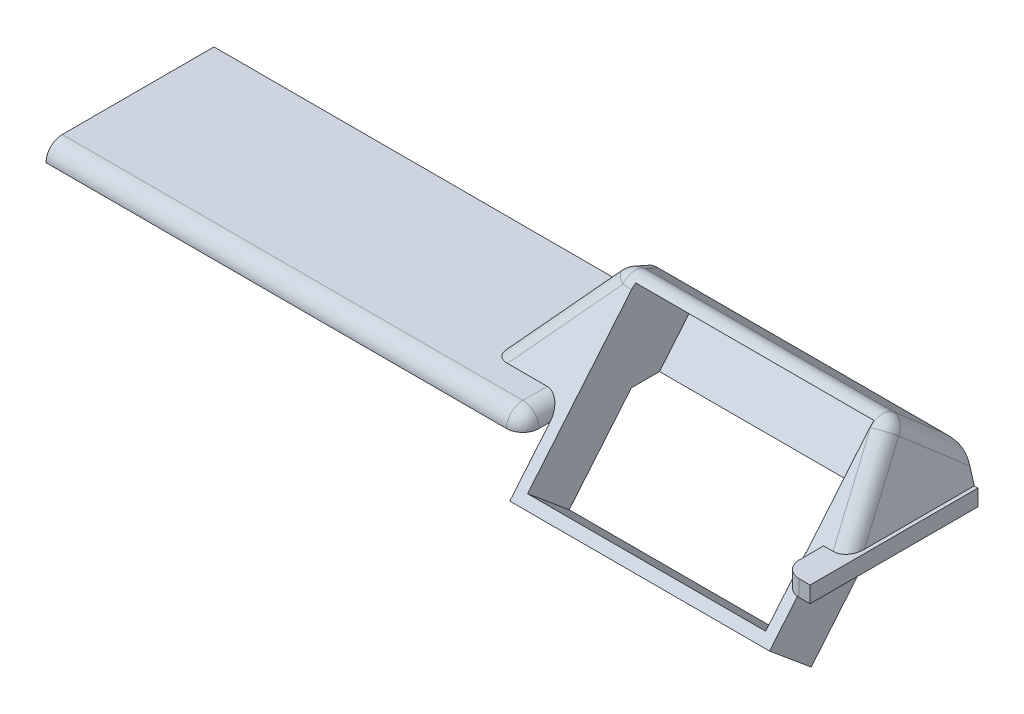
ISO-10303-21;
HEADER;
FILE_DESCRIPTION(('STEP AP214'),'2;1');
FILE_NAME('part.step','',(''),(''),'','','');
FILE_SCHEMA(('AUTOMOTIVE_DESIGN { 1 0 10303 214 1 1 1 1 }'));
ENDSEC;
DATA;
#1=APPLICATION_CONTEXT('core data for automotive mechanical design processes');
#2=APPLICATION_PROTOCOL_DEFINITION('international standard','automotive_design',2000,#1);
#3=PRODUCT_CONTEXT('',#1,'mechanical');
#4=PRODUCT('Part','Part','',(#3));
#5=PRODUCT_RELATED_PRODUCT_CATEGORY('part','',(#4));
#6=PRODUCT_DEFINITION_FORMATION('','',#4);
#7=PRODUCT_DEFINITION_CONTEXT('part definition',#1,'design');
#8=PRODUCT_DEFINITION('design','',#6,#7);
#9=PRODUCT_DEFINITION_SHAPE('','',#8);
#10=(LENGTH_UNIT() NAMED_UNIT(*) SI_UNIT(.MILLI.,.METRE.));
#11=(NAMED_UNIT(*) PLANE_ANGLE_UNIT() SI_UNIT($,.RADIAN.));
#12=(NAMED_UNIT(*) SI_UNIT($,.STERADIAN.) SOLID_ANGLE_UNIT());
#13=UNCERTAINTY_MEASURE_WITH_UNIT(LENGTH_MEASURE(1.E-05),#10,'distance_accuracy_value','');
#14=(GEOMETRIC_REPRESENTATION_CONTEXT(3) GLOBAL_UNCERTAINTY_ASSIGNED_CONTEXT((#13)) GLOBAL_UNIT_ASSIGNED_CONTEXT((#10,
#11,#12)) REPRESENTATION_CONTEXT('',''));
#15=CARTESIAN_POINT('',(0.,0.,0.));
#16=DIRECTION('',(0.,0.,1.));
#17=DIRECTION('',(1.,0.,0.));
#18=AXIS2_PLACEMENT_3D('',#15,#16,#17);
#19=CARTESIAN_POINT('',(0.,3.,0.));
#20=DIRECTION('',(0.,1.,0.));
#21=DIRECTION('',(0.,0.,1.));
#22=AXIS2_PLACEMENT_3D('',#19,#20,#21);
#23=PLANE('',#22);
#24=DIRECTION('',(1.,0.,0.));
#25=VECTOR('',#24,1.);
#26=CARTESIAN_POINT('',(14.5,3.,12.5));
#27=LINE('',#26,#25);
#28=CARTESIAN_POINT('',(-70.5,3.,12.5));
#29=VERTEX_POINT('',#28);
#30=CARTESIAN_POINT('',(14.5,3.,12.5));
#31=VERTEX_POINT('',#30);
#32=EDGE_CURVE('E59',#29,#31,#27,.T.);
#33=ORIENTED_EDGE('',*,*,#32,.T.);
#34=DIRECTION('',(0.,0.,-1.));
#35=VECTOR('',#34,1.);
#36=CARTESIAN_POINT('',(14.5,3.,0.));
#37=LINE('',#36,#35);
#38=CARTESIAN_POINT('',(14.5,3.,8.));
#39=VERTEX_POINT('',#38);
#40=EDGE_CURVE('E402',#31,#39,#37,.T.);
#41=ORIENTED_EDGE('',*,*,#40,.T.);
#42=DIRECTION('',(1.,0.,0.));
#43=VECTOR('',#42,1.);
#44=CARTESIAN_POINT('',(-17.6627305207395,3.,8.));
#45=LINE('',#44,#43);
#46=CARTESIAN_POINT('',(7.16815008911601,3.,8.));
#47=VERTEX_POINT('',#46);
#48=EDGE_CURVE('E269',#47,#39,#45,.T.);
#49=ORIENTED_EDGE('',*,*,#48,.F.);
#50=CARTESIAN_POINT('',(8.78609706855595,3.,4.09487516204668));
#51=DIRECTION('',(0.,1.,0.));
#52=DIRECTION('',(-0.710938080641439,0.,0.703254609294434));
#53=AXIS2_PLACEMENT_3D('',#50,#51,#52);
#54=ELLIPSE('',#53,4.6515928374053,3.);
#55=CARTESIAN_POINT('',(4.86343012819505,3.,5.70558670905381));
#56=VERTEX_POINT('',#55);
#57=EDGE_CURVE('E357',#47,#56,#54,.F.);
#58=ORIENTED_EDGE('',*,*,#57,.T.);
#59=DIRECTION('',(0.,0.,1.));
#60=VECTOR('',#59,1.);
#61=CARTESIAN_POINT('',(4.86343012819505,3.,-35.1133347018045));
#62=LINE('',#61,#60);
#63=CARTESIAN_POINT('',(4.86343012819505,3.,-15.5));
#64=VERTEX_POINT('',#63);
#65=EDGE_CURVE('E494',#64,#56,#62,.T.);
#66=ORIENTED_EDGE('',*,*,#65,.F.);
#67=DIRECTION('',(-1.,0.,0.));
#68=VECTOR('',#67,1.);
#69=CARTESIAN_POINT('',(-70.5,3.,-15.5));
#70=LINE('',#69,#68);
#71=CARTESIAN_POINT('',(-70.5,3.,-15.5));
#72=VERTEX_POINT('',#71);
#73=EDGE_CURVE('E284',#64,#72,#70,.T.);
#74=ORIENTED_EDGE('',*,*,#73,.T.);
#75=DIRECTION('',(0.,0.,1.));
#76=VECTOR('',#75,1.);
#77=CARTESIAN_POINT('',(-70.5,3.,-15.5));
#78=LINE('',#77,#76);
#79=EDGE_CURVE('E289',#72,#29,#78,.T.);
#80=ORIENTED_EDGE('',*,*,#79,.T.);
#81=EDGE_LOOP('',(#33,#41,#49,#58,#66,#74,#80));
#82=FACE_BOUND('',#81,.T.);
#83=ADVANCED_FACE('F42',(#82),#23,.T.);
#84=DIRECTION('',(0.,0.,1.));
#85=VECTOR('',#84,1.);
#86=CARTESIAN_POINT('',(65.5,3.,8.));
#87=LINE('',#86,#85);
#88=CARTESIAN_POINT('',(65.5,3.,8.));
#89=VERTEX_POINT('',#88);
#90=CARTESIAN_POINT('',(65.5,3.,12.5));
#91=VERTEX_POINT('',#90);
#92=EDGE_CURVE('E250',#89,#91,#87,.T.);
#93=ORIENTED_EDGE('',*,*,#92,.T.);
#94=CARTESIAN_POINT('',(68.5,3.,12.5));
#95=DIRECTION('',(0.,1.,0.));
#96=DIRECTION('',(0.,0.,1.));
#97=AXIS2_PLACEMENT_3D('',#94,#95,#96);
#98=CIRCLE('',#97,3.);
#99=CARTESIAN_POINT('',(68.5,3.,15.5));
#100=VERTEX_POINT('',#99);
#101=EDGE_CURVE('E399',#91,#100,#98,.T.);
#102=ORIENTED_EDGE('',*,*,#101,.T.);
#103=DIRECTION('',(1.,0.,0.));
#104=VECTOR('',#103,1.);
#105=CARTESIAN_POINT('',(-70.5,3.,15.5));
#106=LINE('',#105,#104);
#107=CARTESIAN_POINT('',(70.5,3.,15.5));
#108=VERTEX_POINT('',#107);
#109=EDGE_CURVE('E291',#100,#108,#106,.T.);
#110=ORIENTED_EDGE('',*,*,#109,.T.);
#111=DIRECTION('',(0.,0.,-1.));
#112=VECTOR('',#111,1.);
#113=CARTESIAN_POINT('',(70.5,3.,-15.5));
#114=LINE('',#113,#112);
#115=CARTESIAN_POINT('',(70.5,3.,-15.5));
#116=VERTEX_POINT('',#115);
#117=EDGE_CURVE('E282',#108,#116,#114,.T.);
#118=ORIENTED_EDGE('',*,*,#117,.T.);
#119=CARTESIAN_POINT('',(69.812076193566,3.,-15.5));
#120=VERTEX_POINT('',#119);
#121=EDGE_CURVE('E286',#116,#120,#70,.T.);
#122=ORIENTED_EDGE('',*,*,#121,.T.);
#123=DIRECTION('',(0.,0.,1.));
#124=VECTOR('',#123,1.);
#125=CARTESIAN_POINT('',(69.812076193566,3.,-35.1133347018045));
#126=LINE('',#125,#124);
#127=CARTESIAN_POINT('',(69.812076193566,3.,4.78558102168205));
#128=VERTEX_POINT('',#127);
#129=EDGE_CURVE('E259',#120,#128,#126,.T.);
#130=ORIENTED_EDGE('',*,*,#129,.T.);
#131=CARTESIAN_POINT('',(66.6905765469274,3.,4.09487516204668));
#132=DIRECTION('',(0.,1.,0.));
#133=DIRECTION('',(0.326107703459853,0.,0.945332621749689));
#134=AXIS2_PLACEMENT_3D('',#131,#132,#133);
#135=ELLIPSE('',#134,3.99921992943183,3.);
#136=CARTESIAN_POINT('',(67.2426813287845,3.,8.));
#137=VERTEX_POINT('',#136);
#138=EDGE_CURVE('E254',#128,#137,#135,.F.);
#139=ORIENTED_EDGE('',*,*,#138,.T.);
#140=DIRECTION('',(-1.,0.,0.));
#141=VECTOR('',#140,1.);
#142=CARTESIAN_POINT('',(95.5,3.,8.));
#143=LINE('',#142,#141);
#144=EDGE_CURVE('E247',#137,#89,#143,.T.);
#145=ORIENTED_EDGE('',*,*,#144,.T.);
#146=EDGE_LOOP('',(#93,#102,#110,#118,#122,#130,#139,#145));
#147=FACE_BOUND('',#146,.T.);
#148=ADVANCED_FACE('F249',(#147),#23,.T.);
#149=CARTESIAN_POINT('',(-70.5,3.,15.5));
#150=DIRECTION('',(0.,0.,-1.));
#151=DIRECTION('',(-1.,0.,0.));
#152=AXIS2_PLACEMENT_3D('',#149,#150,#151);
#153=PLANE('',#152);
#154=ORIENTED_EDGE('',*,*,#109,.F.);
#155=DIRECTION('',(0.,-1.,0.));
#156=VECTOR('',#155,1.);
#157=CARTESIAN_POINT('',(68.5,0.,15.5));
#158=LINE('',#157,#156);
#159=CARTESIAN_POINT('',(68.5,0.,15.5));
#160=VERTEX_POINT('',#159);
#161=EDGE_CURVE('E395',#100,#160,#158,.T.);
#162=ORIENTED_EDGE('',*,*,#161,.T.);
#163=DIRECTION('',(1.,0.,0.));
#164=VECTOR('',#163,1.);
#165=CARTESIAN_POINT('',(-70.5,0.,15.5));
#166=LINE('',#165,#164);
#167=CARTESIAN_POINT('',(70.5,0.,15.5));
#168=VERTEX_POINT('',#167);
#169=EDGE_CURVE('E301',#160,#168,#166,.T.);
#170=ORIENTED_EDGE('',*,*,#169,.T.);
#171=DIRECTION('',(0.,-1.,0.));
#172=VECTOR('',#171,1.);
#173=CARTESIAN_POINT('',(70.5,3.,15.5));
#174=LINE('',#173,#172);
#175=EDGE_CURVE('E293',#108,#168,#174,.T.);
#176=ORIENTED_EDGE('',*,*,#175,.F.);
#177=EDGE_LOOP('',(#154,#162,#170,#176));
#178=FACE_BOUND('',#177,.T.);
#179=ADVANCED_FACE('F596',(#178),#153,.F.);
#180=CARTESIAN_POINT('',(0.,0.,0.));
#181=DIRECTION('',(0.,1.,0.));
#182=DIRECTION('',(0.,0.,1.));
#183=AXIS2_PLACEMENT_3D('',#180,#181,#182);
#184=PLANE('',#183);
#185=DIRECTION('',(0.,0.,1.));
#186=VECTOR('',#185,1.);
#187=CARTESIAN_POINT('',(17.5,0.,10.5));
#188=LINE('',#187,#186);
#189=CARTESIAN_POINT('',(17.5,0.,10.5));
#190=VERTEX_POINT('',#189);
#191=CARTESIAN_POINT('',(17.5,0.,12.5));
#192=VERTEX_POINT('',#191);
#193=EDGE_CURVE('E276',#190,#192,#188,.T.);
#194=ORIENTED_EDGE('',*,*,#193,.T.);
#195=CARTESIAN_POINT('',(14.5,0.,12.5));
#196=DIRECTION('',(0.,1.,0.));
#197=DIRECTION('',(0.,0.,1.));
#198=AXIS2_PLACEMENT_3D('',#195,#196,#197);
#199=CIRCLE('',#198,3.);
#200=CARTESIAN_POINT('',(14.5,0.,15.5));
#201=VERTEX_POINT('',#200);
#202=EDGE_CURVE('E393',#192,#201,#199,.F.);
#203=ORIENTED_EDGE('',*,*,#202,.T.);
#204=CARTESIAN_POINT('',(-70.5,0.,15.5));
#205=VERTEX_POINT('',#204);
#206=EDGE_CURVE('E285',#205,#201,#166,.T.);
#207=ORIENTED_EDGE('',*,*,#206,.F.);
#208=DIRECTION('',(0.,0.,1.));
#209=VECTOR('',#208,1.);
#210=CARTESIAN_POINT('',(-70.5,0.,-15.5));
#211=LINE('',#210,#209);
#212=CARTESIAN_POINT('',(-70.5,0.,-15.5));
#213=VERTEX_POINT('',#212);
#214=EDGE_CURVE('E299',#213,#205,#211,.T.);
#215=ORIENTED_EDGE('',*,*,#214,.F.);
#216=DIRECTION('',(-1.,0.,0.));
#217=VECTOR('',#216,1.);
#218=CARTESIAN_POINT('',(-70.5,0.,-15.5));
#219=LINE('',#218,#217);
#220=CARTESIAN_POINT('',(70.5,0.,-15.5));
#221=VERTEX_POINT('',#220);
#222=EDGE_CURVE('E297',#221,#213,#219,.T.);
#223=ORIENTED_EDGE('',*,*,#222,.F.);
#224=DIRECTION('',(0.,0.,-1.));
#225=VECTOR('',#224,1.);
#226=CARTESIAN_POINT('',(70.5,0.,-15.5));
#227=LINE('',#226,#225);
#228=EDGE_CURVE('E294',#168,#221,#227,.T.);
#229=ORIENTED_EDGE('',*,*,#228,.F.);
#230=ORIENTED_EDGE('',*,*,#169,.F.);
#231=CARTESIAN_POINT('',(68.5,0.,12.5));
#232=DIRECTION('',(0.,1.,0.));
#233=DIRECTION('',(0.,0.,1.));
#234=AXIS2_PLACEMENT_3D('',#231,#232,#233);
#235=CIRCLE('',#234,3.);
#236=CARTESIAN_POINT('',(65.5,0.,12.5));
#237=VERTEX_POINT('',#236);
#238=EDGE_CURVE('E387',#160,#237,#235,.F.);
#239=ORIENTED_EDGE('',*,*,#238,.T.);
#240=DIRECTION('',(0.,0.,-1.));
#241=VECTOR('',#240,1.);
#242=CARTESIAN_POINT('',(65.5,0.,10.5));
#243=LINE('',#242,#241);
#244=CARTESIAN_POINT('',(65.5,0.,10.5));
#245=VERTEX_POINT('',#244);
#246=EDGE_CURVE('E274',#237,#245,#243,.T.);
#247=ORIENTED_EDGE('',*,*,#246,.T.);
#248=DIRECTION('',(1.,0.,0.));
#249=VECTOR('',#248,1.);
#250=CARTESIAN_POINT('',(-12.9795013082564,0.,10.5));
#251=LINE('',#250,#249);
#252=CARTESIAN_POINT('',(65.4415091486555,0.,10.5));
#253=VERTEX_POINT('',#252);
#254=EDGE_CURVE('E273',#253,#245,#251,.T.);
#255=ORIENTED_EDGE('',*,*,#254,.F.);
#256=DIRECTION('',(0.,0.,-1.));
#257=VECTOR('',#256,1.);
#258=CARTESIAN_POINT('',(65.4415091486555,0.,0.));
#259=LINE('',#258,#257);
#260=CARTESIAN_POINT('',(65.4415091486555,0.,-2.51708279317776));
#261=VERTEX_POINT('',#260);
#262=EDGE_CURVE('E426',#253,#261,#259,.T.);
#263=ORIENTED_EDGE('',*,*,#262,.T.);
#264=DIRECTION('',(1.,0.,0.));
#265=VECTOR('',#264,1.);
#266=CARTESIAN_POINT('',(0.,0.,-2.51708279317776));
#267=LINE('',#266,#265);
#268=CARTESIAN_POINT('',(63.5,0.,-2.51708279317776));
#269=VERTEX_POINT('',#268);
#270=EDGE_CURVE('E425',#269,#261,#267,.T.);
#271=ORIENTED_EDGE('',*,*,#270,.F.);
#272=DIRECTION('',(0.,0.,-1.));
#273=VECTOR('',#272,1.);
#274=CARTESIAN_POINT('',(63.5,0.,0.));
#275=LINE('',#274,#273);
#276=CARTESIAN_POINT('',(63.5,0.,-7.72391591044887));
#277=VERTEX_POINT('',#276);
#278=EDGE_CURVE('E453',#269,#277,#275,.T.);
#279=ORIENTED_EDGE('',*,*,#278,.T.);
#280=DIRECTION('',(1.,0.,0.));
#281=VECTOR('',#280,1.);
#282=CARTESIAN_POINT('',(0.,0.,-7.72391591044886));
#283=LINE('',#282,#281);
#284=CARTESIAN_POINT('',(19.5,0.,-7.72391591044887));
#285=VERTEX_POINT('',#284);
#286=EDGE_CURVE('E327',#285,#277,#283,.T.);
#287=ORIENTED_EDGE('',*,*,#286,.F.);
#288=DIRECTION('',(0.,0.,1.));
#289=VECTOR('',#288,1.);
#290=CARTESIAN_POINT('',(19.5,0.,0.));
#291=LINE('',#290,#289);
#292=CARTESIAN_POINT('',(19.5,0.,-2.51708279317775));
#293=VERTEX_POINT('',#292);
#294=EDGE_CURVE('E444',#285,#293,#291,.T.);
#295=ORIENTED_EDGE('',*,*,#294,.T.);
#296=CARTESIAN_POINT('',(17.5,0.,-2.51708279317776));
#297=VERTEX_POINT('',#296);
#298=EDGE_CURVE('E278',#297,#293,#267,.T.);
#299=ORIENTED_EDGE('',*,*,#298,.F.);
#300=DIRECTION('',(0.,0.,1.));
#301=VECTOR('',#300,1.);
#302=CARTESIAN_POINT('',(17.5,0.,0.));
#303=LINE('',#302,#301);
#304=EDGE_CURVE('E421',#297,#190,#303,.T.);
#305=ORIENTED_EDGE('',*,*,#304,.T.);
#306=EDGE_LOOP('',(#194,#203,#207,#215,#223,#229,#230,#239,#247,#255,#263,#271,#279,#287,#295,
#299,#305));
#307=FACE_BOUND('',#306,.T.);
#308=ADVANCED_FACE('F418',(#307),#184,.F.);
#309=CARTESIAN_POINT('',(70.5,3.,-15.5));
#310=DIRECTION('',(-1.,0.,0.));
#311=DIRECTION('',(0.,0.,1.));
#312=AXIS2_PLACEMENT_3D('',#309,#310,#311);
#313=PLANE('',#312);
#314=ORIENTED_EDGE('',*,*,#228,.T.);
#315=DIRECTION('',(0.,-1.,0.));
#316=VECTOR('',#315,1.);
#317=CARTESIAN_POINT('',(70.5,3.,-15.5));
#318=LINE('',#317,#316);
#319=EDGE_CURVE('E309',#116,#221,#318,.T.);
#320=ORIENTED_EDGE('',*,*,#319,.F.);
#321=ORIENTED_EDGE('',*,*,#117,.F.);
#322=ORIENTED_EDGE('',*,*,#175,.T.);
#323=EDGE_LOOP('',(#314,#320,#321,#322));
#324=FACE_BOUND('',#323,.T.);
#325=ADVANCED_FACE('F602',(#324),#313,.F.);
#326=CARTESIAN_POINT('',(-70.5,3.,-15.5));
#327=DIRECTION('',(0.,0.,1.));
#328=DIRECTION('',(1.,0.,0.));
#329=AXIS2_PLACEMENT_3D('',#326,#327,#328);
#330=PLANE('',#329);
#331=DIRECTION('',(1.,0.,0.));
#332=VECTOR('',#331,1.);
#333=CARTESIAN_POINT('',(68.1351576738459,7.42820849538,-15.5));
#334=LINE('',#333,#332);
#335=CARTESIAN_POINT('',(8.65517811175093,7.42820849537999,-15.5));
#336=VERTEX_POINT('',#335);
#337=CARTESIAN_POINT('',(68.1850973815483,7.42820849538,-15.5));
#338=VERTEX_POINT('',#337);
#339=EDGE_CURVE('E331',#336,#338,#334,.T.);
#340=ORIENTED_EDGE('',*,*,#339,.T.);
#341=CARTESIAN_POINT('',(66.1362710836501,4.92820849538,-15.5));
#342=DIRECTION('',(0.,0.,1.));
#343=DIRECTION('',(-0.276282343854148,0.961076514370453,0.));
#344=AXIS2_PLACEMENT_3D('',#341,#342,#343);
#345=ELLIPSE('',#344,3.97070523087916,3.);
#346=CARTESIAN_POINT('',(69.0195006267614,5.75705552694244,-15.5));
#347=VERTEX_POINT('',#346);
#348=EDGE_CURVE('E334',#338,#347,#345,.F.);
#349=ORIENTED_EDGE('',*,*,#348,.T.);
#350=DIRECTION('',(0.276282343854148,-0.961076514370452,0.));
#351=VECTOR('',#350,1.);
#352=CARTESIAN_POINT('',(65.5,18.,-15.5));
#353=LINE('',#352,#351);
#354=EDGE_CURVE('E497',#347,#120,#353,.T.);
#355=ORIENTED_EDGE('',*,*,#354,.T.);
#356=ORIENTED_EDGE('',*,*,#121,.F.);
#357=ORIENTED_EDGE('',*,*,#319,.T.);
#358=ORIENTED_EDGE('',*,*,#222,.T.);
#359=DIRECTION('',(0.,-1.,0.));
#360=VECTOR('',#359,1.);
#361=CARTESIAN_POINT('',(-70.5,3.,-15.5));
#362=LINE('',#361,#360);
#363=EDGE_CURVE('E306',#72,#213,#362,.T.);
#364=ORIENTED_EDGE('',*,*,#363,.F.);
#365=ORIENTED_EDGE('',*,*,#73,.F.);
#366=DIRECTION('',(0.644284618802856,0.7647858065982,0.));
#367=VECTOR('',#366,1.);
#368=CARTESIAN_POINT('',(17.5,18.,-15.5));
#369=LINE('',#368,#367);
#370=CARTESIAN_POINT('',(8.11613574071316,6.86106235178856,-15.5));
#371=VERTEX_POINT('',#370);
#372=EDGE_CURVE('E487',#64,#371,#369,.T.);
#373=ORIENTED_EDGE('',*,*,#372,.T.);
#374=CARTESIAN_POINT('',(10.4104931605078,4.92820849537999,-15.5));
#375=DIRECTION('',(0.,0.,1.));
#376=DIRECTION('',(-0.644284618802856,-0.7647858065982,0.));
#377=AXIS2_PLACEMENT_3D('',#374,#375,#376);
#378=ELLIPSE('',#377,4.43684979000056,3.);
#379=EDGE_CURVE('E329',#371,#336,#378,.F.);
#380=ORIENTED_EDGE('',*,*,#379,.T.);
#381=EDGE_LOOP('',(#340,#349,#355,#356,#357,#358,#364,#365,#373,#380));
#382=FACE_BOUND('',#381,.T.);
#383=ADVANCED_FACE('F609',(#382),#330,.F.);
#384=CARTESIAN_POINT('',(-70.5,3.,-15.5));
#385=DIRECTION('',(1.,0.,0.));
#386=DIRECTION('',(0.,0.,-1.));
#387=AXIS2_PLACEMENT_3D('',#384,#385,#386);
#388=PLANE('',#387);
#389=ORIENTED_EDGE('',*,*,#214,.T.);
#390=CARTESIAN_POINT('',(-70.5,0.,12.5));
#391=DIRECTION('',(1.,0.,0.));
#392=DIRECTION('',(0.,0.,-1.));
#393=AXIS2_PLACEMENT_3D('',#390,#391,#392);
#394=CIRCLE('',#393,3.);
#395=EDGE_CURVE('E51',#205,#29,#394,.F.);
#396=ORIENTED_EDGE('',*,*,#395,.T.);
#397=ORIENTED_EDGE('',*,*,#79,.F.);
#398=ORIENTED_EDGE('',*,*,#363,.T.);
#399=EDGE_LOOP('',(#389,#396,#397,#398));
#400=FACE_BOUND('',#399,.T.);
#401=ADVANCED_FACE('F606',(#400),#388,.F.);
#402=CARTESIAN_POINT('',(-12.9795013082564,18.,-4.5));
#403=DIRECTION('',(0.,-0.64018439966448,-0.768221279597376));
#404=DIRECTION('',(0.,0.768221279597376,-0.64018439966448));
#405=AXIS2_PLACEMENT_3D('',#402,#403,#404);
#406=PLANE('',#405);
#407=DIRECTION('',(-0.215645864426296,0.750146291761006,-0.625121909800838));
#408=VECTOR('',#407,1.);
#409=CARTESIAN_POINT('',(63.0500900613609,17.584359410251,-4.15363284187586));
#410=LINE('',#409,#408);
#411=CARTESIAN_POINT('',(63.593130873447,15.6953361612079,-2.57944680100656));
#412=VERTEX_POINT('',#411);
#413=EDGE_CURVE('E353',#137,#412,#410,.T.);
#414=ORIENTED_EDGE('',*,*,#413,.T.);
#415=DIRECTION('',(1.,0.,0.));
#416=VECTOR('',#415,1.);
#417=CARTESIAN_POINT('',(19.4741947202085,15.6953361612079,-2.57944680100656));
#418=LINE('',#417,#416);
#419=CARTESIAN_POINT('',(63.5,15.6953361612079,-2.57944680100656));
#420=VERTEX_POINT('',#419);
#421=EDGE_CURVE('E375',#412,#420,#418,.F.);
#422=ORIENTED_EDGE('',*,*,#421,.T.);
#423=DIRECTION('',(0.,0.768221279597376,-0.64018439966448));
#424=VECTOR('',#423,1.);
#425=CARTESIAN_POINT('',(63.5,3.,8.));
#426=LINE('',#425,#424);
#427=CARTESIAN_POINT('',(63.5,1.53644255919475,9.21963120067104));
#428=VERTEX_POINT('',#427);
#429=EDGE_CURVE('E484',#428,#420,#426,.T.);
#430=ORIENTED_EDGE('',*,*,#429,.F.);
#431=DIRECTION('',(1.,0.,0.));
#432=VECTOR('',#431,1.);
#433=CARTESIAN_POINT('',(63.4415091486555,1.53644255919475,9.21963120067104));
#434=LINE('',#433,#432);
#435=CARTESIAN_POINT('',(63.4415091486555,1.53644255919475,9.21963120067104));
#436=VERTEX_POINT('',#435);
#437=EDGE_CURVE('E473',#436,#428,#434,.T.);
#438=ORIENTED_EDGE('',*,*,#437,.F.);
#439=DIRECTION('',(0.,0.768221279597376,-0.64018439966448));
#440=VECTOR('',#439,1.);
#441=CARTESIAN_POINT('',(63.4415091486555,-7.3513022267134,16.6260851889278));
#442=LINE('',#441,#440);
#443=CARTESIAN_POINT('',(63.4415091486555,-7.3513022267134,16.6260851889278));
#444=VERTEX_POINT('',#443);
#445=EDGE_CURVE('E476',#444,#436,#442,.T.);
#446=ORIENTED_EDGE('',*,*,#445,.F.);
#447=DIRECTION('',(1.,0.,0.));
#448=VECTOR('',#447,1.);
#449=CARTESIAN_POINT('',(19.5,-7.35130222671341,16.6260851889278));
#450=LINE('',#449,#448);
#451=CARTESIAN_POINT('',(19.5,-7.35130222671341,16.6260851889278));
#452=VERTEX_POINT('',#451);
#453=EDGE_CURVE('E479',#452,#444,#450,.T.);
#454=ORIENTED_EDGE('',*,*,#453,.F.);
#455=DIRECTION('',(0.,-0.768221279597376,0.64018439966448));
#456=VECTOR('',#455,1.);
#457=CARTESIAN_POINT('',(19.5,0.,10.5));
#458=LINE('',#457,#456);
#459=CARTESIAN_POINT('',(19.5,15.6953361612079,-2.57944680100655));
#460=VERTEX_POINT('',#459);
#461=EDGE_CURVE('E482',#460,#452,#458,.T.);
#462=ORIENTED_EDGE('',*,*,#461,.F.);
#463=DIRECTION('',(1.,0.,0.));
#464=VECTOR('',#463,1.);
#465=CARTESIAN_POINT('',(19.4741947202085,15.6953361612079,-2.57944680100656));
#466=LINE('',#465,#464);
#467=CARTESIAN_POINT('',(17.863183585593,15.6953361612079,-2.57944680100656));
#468=VERTEX_POINT('',#467);
#469=EDGE_CURVE('E373',#460,#468,#466,.F.);
#470=ORIENTED_EDGE('',*,*,#469,.T.);
#471=DIRECTION('',(0.543322268887735,0.644940368786324,-0.537450307321937));
#472=VECTOR('',#471,1.);
#473=CARTESIAN_POINT('',(6.48779885885794,2.19240200802898,8.67299832664252));
#474=LINE('',#473,#472);
#475=EDGE_CURVE('E355',#468,#47,#474,.F.);
#476=ORIENTED_EDGE('',*,*,#475,.T.);
#477=ORIENTED_EDGE('',*,*,#48,.T.);
#478=CARTESIAN_POINT('',(14.5,0.,10.5));
#479=DIRECTION('',(0.,-0.64018439966448,-0.768221279597376));
#480=DIRECTION('',(0.,0.768221279597376,-0.64018439966448));
#481=AXIS2_PLACEMENT_3D('',#478,#479,#480);
#482=ELLIPSE('',#481,3.90512483795333,3.);
#483=EDGE_CURVE('E11',#39,#190,#482,.T.);
#484=ORIENTED_EDGE('',*,*,#483,.T.);
#485=DIRECTION('',(0.,-0.768221279597376,0.64018439966448));
#486=VECTOR('',#485,1.);
#487=CARTESIAN_POINT('',(17.5,18.,-4.5));
#488=LINE('',#487,#486);
#489=CARTESIAN_POINT('',(17.5,-8.88774478590816,17.9064539882568));
#490=VERTEX_POINT('',#489);
#491=EDGE_CURVE('E440',#190,#490,#488,.T.);
#492=ORIENTED_EDGE('',*,*,#491,.T.);
#493=DIRECTION('',(1.,0.,0.));
#494=VECTOR('',#493,1.);
#495=CARTESIAN_POINT('',(17.5,-8.88774478590816,17.9064539882568));
#496=LINE('',#495,#494);
#497=CARTESIAN_POINT('',(65.4415091486555,-8.88774478590815,17.9064539882568));
#498=VERTEX_POINT('',#497);
#499=EDGE_CURVE('E436',#490,#498,#496,.T.);
#500=ORIENTED_EDGE('',*,*,#499,.T.);
#501=DIRECTION('',(0.,0.768221279597376,-0.64018439966448));
#502=VECTOR('',#501,1.);
#503=CARTESIAN_POINT('',(65.4415091486555,18.,-4.50000000000001));
#504=LINE('',#503,#502);
#505=EDGE_CURVE('E442',#498,#253,#504,.T.);
#506=ORIENTED_EDGE('',*,*,#505,.T.);
#507=ORIENTED_EDGE('',*,*,#254,.T.);
#508=DIRECTION('',(0.,0.768221279597376,-0.64018439966448));
#509=VECTOR('',#508,1.);
#510=CARTESIAN_POINT('',(65.5,18.,-4.5));
#511=LINE('',#510,#509);
#512=EDGE_CURVE('E265',#245,#89,#511,.T.);
#513=ORIENTED_EDGE('',*,*,#512,.T.);
#514=ORIENTED_EDGE('',*,*,#144,.F.);
#515=EDGE_LOOP('',(#414,#422,#430,#438,#446,#454,#462,#470,#476,#477,#484,#492,#500,#506,#507,
#513,#514));
#516=FACE_BOUND('',#515,.T.);
#517=ADVANCED_FACE('F271',(#516),#406,.F.);
#518=CARTESIAN_POINT('',(65.5,0.,0.));
#519=DIRECTION('',(-1.,0.,0.));
#520=DIRECTION('',(0.,0.,1.));
#521=AXIS2_PLACEMENT_3D('',#518,#519,#520);
#522=PLANE('',#521);
#523=ORIENTED_EDGE('',*,*,#246,.F.);
#524=DIRECTION('',(0.,-1.,0.));
#525=VECTOR('',#524,1.);
#526=CARTESIAN_POINT('',(65.5,3.,12.5));
#527=LINE('',#526,#525);
#528=EDGE_CURVE('E268',#237,#91,#527,.F.);
#529=ORIENTED_EDGE('',*,*,#528,.T.);
#530=ORIENTED_EDGE('',*,*,#92,.F.);
#531=ORIENTED_EDGE('',*,*,#512,.F.);
#532=EDGE_LOOP('',(#523,#529,#530,#531));
#533=FACE_BOUND('',#532,.T.);
#534=ADVANCED_FACE('F264',(#533),#522,.T.);
#535=CARTESIAN_POINT('',(17.5,11.5981560033552,-12.1822127959738));
#536=DIRECTION('',(0.,0.768221279597376,-0.64018439966448));
#537=DIRECTION('',(0.,0.64018439966448,0.768221279597376));
#538=AXIS2_PLACEMENT_3D('',#535,#536,#537);
#539=PLANE('',#538);
#540=DIRECTION('',(-0.474682506354106,-0.56346284375782,-0.676155412509383));
#541=VECTOR('',#540,1.);
#542=CARTESIAN_POINT('',(14.8567835528019,12.5107568044842,-11.0870918346189));
#543=LINE('',#542,#541);
#544=CARTESIAN_POINT('',(12.5165881391419,9.73287233417212,-14.4205531989934));
#545=VERTEX_POINT('',#544);
#546=CARTESIAN_POINT('',(17.863183585593,16.0794468010066,-6.80466383879213));
#547=VERTEX_POINT('',#546);
#548=EDGE_CURVE('E340',#545,#547,#543,.F.);
#549=ORIENTED_EDGE('',*,*,#548,.T.);
#550=DIRECTION('',(1.,0.,0.));
#551=VECTOR('',#550,1.);
#552=CARTESIAN_POINT('',(19.8047199609209,16.0794468010066,-6.80466383879213));
#553=LINE('',#552,#551);
#554=CARTESIAN_POINT('',(63.593130873447,16.0794468010066,-6.80466383879213));
#555=VERTEX_POINT('',#554);
#556=EDGE_CURVE('E371',#547,#555,#553,.T.);
#557=ORIENTED_EDGE('',*,*,#556,.T.);
#558=DIRECTION('',(-0.180995395982897,0.629611077789946,0.755533293347935));
#559=VECTOR('',#558,1.);
#560=CARTESIAN_POINT('',(63.3291930934958,16.9975814817378,-5.70290222191466));
#561=LINE('',#560,#559);
#562=CARTESIAN_POINT('',(65.4175917180557,9.73287233417212,-14.4205531989934));
#563=VERTEX_POINT('',#562);
#564=EDGE_CURVE('E336',#555,#563,#561,.F.);
#565=ORIENTED_EDGE('',*,*,#564,.T.);
#566=DIRECTION('',(1.,0.,0.));
#567=VECTOR('',#566,1.);
#568=CARTESIAN_POINT('',(9.77765174500807,9.73287233417212,-14.4205531989934));
#569=LINE('',#568,#567);
#570=EDGE_CURVE('E338',#563,#545,#569,.F.);
#571=ORIENTED_EDGE('',*,*,#570,.T.);
#572=EDGE_LOOP('',(#549,#557,#565,#571));
#573=FACE_BOUND('',#572,.T.);
#574=ADVANCED_FACE('F532',(#573),#539,.T.);
#575=CARTESIAN_POINT('',(0.,-1.23790957041529,-1.48549148449835));
#576=DIRECTION('',(0.,0.64018439966448,0.768221279597376));
#577=DIRECTION('',(0.,-0.768221279597376,0.64018439966448));
#578=AXIS2_PLACEMENT_3D('',#575,#576,#577);
#579=PLANE('',#578);
#580=ORIENTED_EDGE('',*,*,#298,.T.);
#581=DIRECTION('',(0.,-0.768221279597376,0.64018439966448));
#582=VECTOR('',#581,1.);
#583=CARTESIAN_POINT('',(19.5,-1.2379095704153,-1.48549148449834));
#584=LINE('',#583,#582);
#585=CARTESIAN_POINT('',(19.5,-13.7531462233582,8.94387239295409));
#586=VERTEX_POINT('',#585);
#587=EDGE_CURVE('E324',#293,#586,#584,.T.);
#588=ORIENTED_EDGE('',*,*,#587,.T.);
#589=DIRECTION('',(1.,0.,0.));
#590=VECTOR('',#589,1.);
#591=CARTESIAN_POINT('',(0.,-13.7531462233582,8.94387239295409));
#592=LINE('',#591,#590);
#593=CARTESIAN_POINT('',(63.4415091486555,-13.7531462233582,8.94387239295408));
#594=VERTEX_POINT('',#593);
#595=EDGE_CURVE('E321',#586,#594,#592,.T.);
#596=ORIENTED_EDGE('',*,*,#595,.T.);
#597=DIRECTION('',(0.,0.768221279597376,-0.64018439966448));
#598=VECTOR('',#597,1.);
#599=CARTESIAN_POINT('',(63.4415091486555,-1.23790957041529,-1.48549148449835));
#600=LINE('',#599,#598);
#601=CARTESIAN_POINT('',(63.4415091486555,-4.86540143745005,1.53741840469728));
#602=VERTEX_POINT('',#601);
#603=EDGE_CURVE('E318',#594,#602,#600,.T.);
#604=ORIENTED_EDGE('',*,*,#603,.T.);
#605=DIRECTION('',(1.,0.,0.));
#606=VECTOR('',#605,1.);
#607=CARTESIAN_POINT('',(0.,-4.86540143745005,1.53741840469728));
#608=LINE('',#607,#606);
#609=CARTESIAN_POINT('',(63.5,-4.86540143745005,1.53741840469728));
#610=VERTEX_POINT('',#609);
#611=EDGE_CURVE('E315',#602,#610,#608,.T.);
#612=ORIENTED_EDGE('',*,*,#611,.T.);
#613=DIRECTION('',(0.,0.768221279597376,-0.64018439966448));
#614=VECTOR('',#613,1.);
#615=CARTESIAN_POINT('',(63.5,-1.23790957041529,-1.48549148449835));
#616=LINE('',#615,#614);
#617=EDGE_CURVE('E312',#610,#269,#616,.T.);
#618=ORIENTED_EDGE('',*,*,#617,.T.);
#619=ORIENTED_EDGE('',*,*,#270,.T.);
#620=DIRECTION('',(0.,0.768221279597376,-0.64018439966448));
#621=VECTOR('',#620,1.);
#622=CARTESIAN_POINT('',(65.4415091486555,11.5981560033552,-12.1822127959738));
#623=LINE('',#622,#621);
#624=CARTESIAN_POINT('',(65.4415091486555,-15.289588782553,10.224241192283));
#625=VERTEX_POINT('',#624);
#626=EDGE_CURVE('E439',#625,#261,#623,.T.);
#627=ORIENTED_EDGE('',*,*,#626,.F.);
#628=DIRECTION('',(1.,0.,0.));
#629=VECTOR('',#628,1.);
#630=CARTESIAN_POINT('',(17.5,-15.289588782553,10.224241192283));
#631=LINE('',#630,#629);
#632=CARTESIAN_POINT('',(17.5,-15.289588782553,10.224241192283));
#633=VERTEX_POINT('',#632);
#634=EDGE_CURVE('E434',#633,#625,#631,.T.);
#635=ORIENTED_EDGE('',*,*,#634,.F.);
#636=DIRECTION('',(0.,-0.768221279597376,0.64018439966448));
#637=VECTOR('',#636,1.);
#638=CARTESIAN_POINT('',(17.5,11.5981560033552,-12.1822127959738));
#639=LINE('',#638,#637);
#640=EDGE_CURVE('E447',#297,#633,#639,.T.);
#641=ORIENTED_EDGE('',*,*,#640,.F.);
#642=EDGE_LOOP('',(#580,#588,#596,#604,#612,#618,#619,#627,#635,#641));
#643=FACE_BOUND('',#642,.T.);
#644=ADVANCED_FACE('F570',(#643),#579,.F.);
#645=CARTESIAN_POINT('',(65.4415091486555,11.5981560033552,-12.1822127959738));
#646=DIRECTION('',(1.,0.,0.));
#647=DIRECTION('',(0.,0.,-1.));
#648=AXIS2_PLACEMENT_3D('',#645,#646,#647);
#649=PLANE('',#648);
#650=ORIENTED_EDGE('',*,*,#262,.F.);
#651=ORIENTED_EDGE('',*,*,#505,.F.);
#652=DIRECTION('',(0.,0.64018439966448,0.768221279597376));
#653=VECTOR('',#652,1.);
#654=CARTESIAN_POINT('',(65.4415091486555,-15.289588782553,10.224241192283));
#655=LINE('',#654,#653);
#656=EDGE_CURVE('E430',#625,#498,#655,.T.);
#657=ORIENTED_EDGE('',*,*,#656,.F.);
#658=ORIENTED_EDGE('',*,*,#626,.T.);
#659=EDGE_LOOP('',(#650,#651,#657,#658));
#660=FACE_BOUND('',#659,.T.);
#661=ADVANCED_FACE('F573',(#660),#649,.T.);
#662=CARTESIAN_POINT('',(17.5,11.5981560033552,-12.1822127959738));
#663=DIRECTION('',(-1.,0.,0.));
#664=DIRECTION('',(0.,-1.,0.));
#665=AXIS2_PLACEMENT_3D('',#662,#663,#664);
#666=PLANE('',#665);
#667=ORIENTED_EDGE('',*,*,#304,.F.);
#668=ORIENTED_EDGE('',*,*,#640,.T.);
#669=DIRECTION('',(0.,0.64018439966448,0.768221279597376));
#670=VECTOR('',#669,1.);
#671=CARTESIAN_POINT('',(17.5,-15.289588782553,10.224241192283));
#672=LINE('',#671,#670);
#673=EDGE_CURVE('E431',#633,#490,#672,.T.);
#674=ORIENTED_EDGE('',*,*,#673,.T.);
#675=ORIENTED_EDGE('',*,*,#491,.F.);
#676=EDGE_LOOP('',(#667,#668,#674,#675));
#677=FACE_BOUND('',#676,.T.);
#678=ADVANCED_FACE('F581',(#677),#666,.T.);
#679=CARTESIAN_POINT('',(17.5,-15.289588782553,10.224241192283));
#680=DIRECTION('',(0.,-0.768221279597376,0.64018439966448));
#681=DIRECTION('',(0.,-0.64018439966448,-0.768221279597376));
#682=AXIS2_PLACEMENT_3D('',#679,#680,#681);
#683=PLANE('',#682);
#684=ORIENTED_EDGE('',*,*,#499,.F.);
#685=ORIENTED_EDGE('',*,*,#673,.F.);
#686=ORIENTED_EDGE('',*,*,#634,.T.);
#687=ORIENTED_EDGE('',*,*,#656,.T.);
#688=EDGE_LOOP('',(#684,#685,#686,#687));
#689=FACE_BOUND('',#688,.T.);
#690=ADVANCED_FACE('F577',(#689),#683,.T.);
#691=CARTESIAN_POINT('',(0.,-3.79864716907321,-4.55837660288785));
#692=DIRECTION('',(0.,0.64018439966448,0.768221279597376));
#693=DIRECTION('',(0.,-0.768221279597376,0.64018439966448));
#694=AXIS2_PLACEMENT_3D('',#691,#692,#693);
#695=PLANE('',#694);
#696=ORIENTED_EDGE('',*,*,#286,.T.);
#697=DIRECTION('',(0.,0.768221279597376,-0.64018439966448));
#698=VECTOR('',#697,1.);
#699=CARTESIAN_POINT('',(63.5,-7.42613903610797,-1.53546671369222));
#700=LINE('',#699,#698);
#701=CARTESIAN_POINT('',(63.5,7.50097584550253,-13.9747291150343));
#702=VERTEX_POINT('',#701);
#703=EDGE_CURVE('E475',#277,#702,#700,.T.);
#704=ORIENTED_EDGE('',*,*,#703,.T.);
#705=DIRECTION('',(-1.,0.,0.));
#706=VECTOR('',#705,1.);
#707=CARTESIAN_POINT('',(63.5,7.50097584550253,-13.9747291150343));
#708=LINE('',#707,#706);
#709=CARTESIAN_POINT('',(19.5,7.50097584550253,-13.9747291150343));
#710=VERTEX_POINT('',#709);
#711=EDGE_CURVE('E490',#702,#710,#708,.T.);
#712=ORIENTED_EDGE('',*,*,#711,.T.);
#713=DIRECTION('',(0.,-0.768221279597376,0.64018439966448));
#714=VECTOR('',#713,1.);
#715=CARTESIAN_POINT('',(19.5,7.50097584550253,-13.9747291150343));
#716=LINE('',#715,#714);
#717=EDGE_CURVE('E461',#710,#285,#716,.T.);
#718=ORIENTED_EDGE('',*,*,#717,.T.);
#719=EDGE_LOOP('',(#696,#704,#712,#718));
#720=FACE_BOUND('',#719,.T.);
#721=ADVANCED_FACE('F564',(#720),#695,.T.);
#722=CARTESIAN_POINT('',(63.4415091486555,-7.42613903610797,-1.53546671369222));
#723=DIRECTION('',(0.,-0.768221279597376,0.64018439966448));
#724=DIRECTION('',(0.,-0.64018439966448,-0.768221279597376));
#725=AXIS2_PLACEMENT_3D('',#722,#723,#724);
#726=PLANE('',#725);
#727=DIRECTION('',(0.,0.64018439966448,0.768221279597376));
#728=VECTOR('',#727,1.);
#729=CARTESIAN_POINT('',(63.4415091486555,-7.42613903610797,-1.53546671369222));
#730=LINE('',#729,#728);
#731=EDGE_CURVE('E469',#602,#436,#730,.T.);
#732=ORIENTED_EDGE('',*,*,#731,.T.);
#733=ORIENTED_EDGE('',*,*,#437,.T.);
#734=DIRECTION('',(0.,0.64018439966448,0.768221279597376));
#735=VECTOR('',#734,1.);
#736=CARTESIAN_POINT('',(63.5,-7.42613903610797,-1.53546671369222));
#737=LINE('',#736,#735);
#738=EDGE_CURVE('E456',#610,#428,#737,.T.);
#739=ORIENTED_EDGE('',*,*,#738,.F.);
#740=ORIENTED_EDGE('',*,*,#611,.F.);
#741=EDGE_LOOP('',(#732,#733,#739,#740));
#742=FACE_BOUND('',#741,.T.);
#743=ADVANCED_FACE('F734',(#742),#726,.F.);
#744=CARTESIAN_POINT('',(63.4415091486555,-16.3138838220161,5.87098727456457));
#745=DIRECTION('',(1.,0.,0.));
#746=DIRECTION('',(0.,0.,-1.));
#747=AXIS2_PLACEMENT_3D('',#744,#745,#746);
#748=PLANE('',#747);
#749=DIRECTION('',(0.,0.64018439966448,0.768221279597376));
#750=VECTOR('',#749,1.);
#751=CARTESIAN_POINT('',(63.4415091486555,-16.3138838220161,5.87098727456457));
#752=LINE('',#751,#750);
#753=EDGE_CURVE('E467',#594,#444,#752,.T.);
#754=ORIENTED_EDGE('',*,*,#753,.T.);
#755=ORIENTED_EDGE('',*,*,#445,.T.);
#756=ORIENTED_EDGE('',*,*,#731,.F.);
#757=ORIENTED_EDGE('',*,*,#603,.F.);
#758=EDGE_LOOP('',(#754,#755,#756,#757));
#759=FACE_BOUND('',#758,.T.);
#760=ADVANCED_FACE('F725',(#759),#748,.F.);
#761=CARTESIAN_POINT('',(19.5,-16.3138838220161,5.87098727456458));
#762=DIRECTION('',(0.,-0.768221279597376,0.64018439966448));
#763=DIRECTION('',(0.,-0.64018439966448,-0.768221279597376));
#764=AXIS2_PLACEMENT_3D('',#761,#762,#763);
#765=PLANE('',#764);
#766=DIRECTION('',(0.,0.64018439966448,0.768221279597376));
#767=VECTOR('',#766,1.);
#768=CARTESIAN_POINT('',(19.5,-16.3138838220161,5.87098727456458));
#769=LINE('',#768,#767);
#770=EDGE_CURVE('E464',#586,#452,#769,.T.);
#771=ORIENTED_EDGE('',*,*,#770,.T.);
#772=ORIENTED_EDGE('',*,*,#453,.T.);
#773=ORIENTED_EDGE('',*,*,#753,.F.);
#774=ORIENTED_EDGE('',*,*,#595,.F.);
#775=EDGE_LOOP('',(#771,#772,#773,#774));
#776=FACE_BOUND('',#775,.T.);
#777=ADVANCED_FACE('F718',(#776),#765,.F.);
#778=CARTESIAN_POINT('',(19.5,-8.96258159530273,-0.255097914363258));
#779=DIRECTION('',(-1.,0.,0.));
#780=DIRECTION('',(0.,-1.,0.));
#781=AXIS2_PLACEMENT_3D('',#778,#779,#780);
#782=PLANE('',#781);
#783=DIRECTION('',(0.,0.64018439966448,0.768221279597376));
#784=VECTOR('',#783,1.);
#785=CARTESIAN_POINT('',(19.5,7.50097584550253,-13.9747291150343));
#786=LINE('',#785,#784);
#787=CARTESIAN_POINT('',(19.5,16.3537191626622,-3.35143713444272));
#788=VERTEX_POINT('',#787);
#789=EDGE_CURVE('E460',#710,#788,#786,.T.);
#790=ORIENTED_EDGE('',*,*,#789,.T.);
#791=CARTESIAN_POINT('',(19.5,13.7747829622144,-4.88411063979868));
#792=DIRECTION('',(-1.,0.,0.));
#793=DIRECTION('',(0.,-1.,0.));
#794=AXIS2_PLACEMENT_3D('',#791,#792,#793);
#795=CIRCLE('',#794,3.);
#796=EDGE_CURVE('E381',#788,#460,#795,.F.);
#797=ORIENTED_EDGE('',*,*,#796,.T.);
#798=ORIENTED_EDGE('',*,*,#461,.T.);
#799=ORIENTED_EDGE('',*,*,#770,.F.);
#800=ORIENTED_EDGE('',*,*,#587,.F.);
#801=ORIENTED_EDGE('',*,*,#294,.F.);
#802=ORIENTED_EDGE('',*,*,#717,.F.);
#803=EDGE_LOOP('',(#790,#797,#798,#799,#800,#801,#802));
#804=FACE_BOUND('',#803,.T.);
#805=ADVANCED_FACE('F560',(#804),#782,.F.);
#806=CARTESIAN_POINT('',(63.5,-5.96258159530272,-2.75509791436326));
#807=DIRECTION('',(1.,0.,0.));
#808=DIRECTION('',(0.,0.,-1.));
#809=AXIS2_PLACEMENT_3D('',#806,#807,#808);
#810=PLANE('',#809);
#811=ORIENTED_EDGE('',*,*,#429,.T.);
#812=CARTESIAN_POINT('',(63.5,13.7747829622144,-4.88411063979869));
#813=DIRECTION('',(1.,0.,0.));
#814=DIRECTION('',(0.,0.,-1.));
#815=AXIS2_PLACEMENT_3D('',#812,#813,#814);
#816=CIRCLE('',#815,3.);
#817=CARTESIAN_POINT('',(63.5,16.3537191626622,-3.35143713444273));
#818=VERTEX_POINT('',#817);
#819=EDGE_CURVE('E377',#420,#818,#816,.F.);
#820=ORIENTED_EDGE('',*,*,#819,.T.);
#821=DIRECTION('',(0.,0.64018439966448,0.768221279597376));
#822=VECTOR('',#821,1.);
#823=CARTESIAN_POINT('',(63.5,7.50097584550253,-13.9747291150343));
#824=LINE('',#823,#822);
#825=EDGE_CURVE('E457',#702,#818,#824,.T.);
#826=ORIENTED_EDGE('',*,*,#825,.F.);
#827=ORIENTED_EDGE('',*,*,#703,.F.);
#828=ORIENTED_EDGE('',*,*,#278,.F.);
#829=ORIENTED_EDGE('',*,*,#617,.F.);
#830=ORIENTED_EDGE('',*,*,#738,.T.);
#831=EDGE_LOOP('',(#811,#820,#826,#827,#828,#829,#830));
#832=FACE_BOUND('',#831,.T.);
#833=ADVANCED_FACE('F550',(#832),#810,.F.);
#834=CARTESIAN_POINT('',(63.5,7.50097584550253,-13.9747291150343));
#835=DIRECTION('',(0.,0.768221279597376,-0.64018439966448));
#836=DIRECTION('',(0.,0.64018439966448,0.768221279597376));
#837=AXIS2_PLACEMENT_3D('',#834,#835,#836);
#838=PLANE('',#837);
#839=ORIENTED_EDGE('',*,*,#825,.T.);
#840=DIRECTION('',(-1.,0.,0.));
#841=VECTOR('',#840,1.);
#842=CARTESIAN_POINT('',(63.5,16.3537191626622,-3.35143713444273));
#843=LINE('',#842,#841);
#844=EDGE_CURVE('E379',#818,#788,#843,.T.);
#845=ORIENTED_EDGE('',*,*,#844,.T.);
#846=ORIENTED_EDGE('',*,*,#789,.F.);
#847=ORIENTED_EDGE('',*,*,#711,.F.);
#848=EDGE_LOOP('',(#839,#845,#846,#847));
#849=FACE_BOUND('',#848,.T.);
#850=ADVANCED_FACE('F556',(#849),#838,.F.);
#851=CARTESIAN_POINT('',(17.5,18.,-35.1133347018045));
#852=DIRECTION('',(-0.7647858065982,0.644284618802856,0.));
#853=DIRECTION('',(-0.644284618802856,-0.7647858065982,0.));
#854=AXIS2_PLACEMENT_3D('',#851,#852,#853);
#855=PLANE('',#854);
#856=DIRECTION('',(0.543322268887735,0.644940368786324,-0.537450307321937));
#857=VECTOR('',#856,1.);
#858=CARTESIAN_POINT('',(16.8300113108683,17.2047026654441,-6.13166551214961));
#859=LINE('',#858,#857);
#860=CARTESIAN_POINT('',(15.5688261657984,15.707636818623,-4.88411063979869));
#861=VERTEX_POINT('',#860);
#862=EDGE_CURVE('E348',#56,#861,#859,.T.);
#863=ORIENTED_EDGE('',*,*,#862,.T.);
#864=DIRECTION('',(-0.474682506354106,-0.56346284375782,-0.676155412509383));
#865=VECTOR('',#864,1.);
#866=CARTESIAN_POINT('',(6.91474814946392,5.43497805426513,-17.2113011570281));
#867=LINE('',#866,#865);
#868=EDGE_CURVE('E351',#861,#371,#867,.T.);
#869=ORIENTED_EDGE('',*,*,#868,.T.);
#870=ORIENTED_EDGE('',*,*,#372,.F.);
#871=ORIENTED_EDGE('',*,*,#65,.T.);
#872=EDGE_LOOP('',(#863,#869,#870,#871));
#873=FACE_BOUND('',#872,.T.);
#874=ADVANCED_FACE('F515',(#873),#855,.T.);
#875=CARTESIAN_POINT('',(65.5,18.,-35.1133347018045));
#876=DIRECTION('',(0.961076514370452,0.276282343854148,0.));
#877=DIRECTION('',(-0.276282343854148,0.961076514370452,0.));
#878=AXIS2_PLACEMENT_3D('',#875,#876,#877);
#879=PLANE('',#878);
#880=ORIENTED_EDGE('',*,*,#354,.F.);
#881=DIRECTION('',(-0.180995395982897,0.629611077789946,0.755533293347935));
#882=VECTOR('',#881,1.);
#883=CARTESIAN_POINT('',(70.1911237319427,1.681444199865,-20.3907335924929));
#884=LINE('',#883,#882);
#885=CARTESIAN_POINT('',(66.4763604165584,14.6036299937769,-4.88411063979869));
#886=VERTEX_POINT('',#885);
#887=EDGE_CURVE('E345',#347,#886,#884,.T.);
#888=ORIENTED_EDGE('',*,*,#887,.T.);
#889=DIRECTION('',(-0.215645864426296,0.750146291761006,-0.625121909800838));
#890=VECTOR('',#889,1.);
#891=CARTESIAN_POINT('',(70.2453957980383,1.49265324282004,6.04170331933202));
#892=LINE('',#891,#890);
#893=EDGE_CURVE('E343',#886,#128,#892,.F.);
#894=ORIENTED_EDGE('',*,*,#893,.T.);
#895=ORIENTED_EDGE('',*,*,#129,.F.);
#896=EDGE_LOOP('',(#880,#888,#894,#895));
#897=FACE_BOUND('',#896,.T.);
#898=ADVANCED_FACE('F628',(#897),#879,.T.);
#899=CARTESIAN_POINT('',(28.0637294237636,25.8831469506062,-14.9744139634585));
#900=DIRECTION('',(-0.543322268887735,-0.644940368786324,0.537450307321937));
#901=DIRECTION('',(0.7647858065982,-0.644284618802856,0.));
#902=AXIS2_PLACEMENT_3D('',#899,#900,#901);
#903=CYLINDRICAL_SURFACE('',#902,3.);
#904=ORIENTED_EDGE('',*,*,#475,.F.);
#905=CARTESIAN_POINT('',(17.863183585593,13.7747829622144,-4.88411063979869));
#906=DIRECTION('',(-0.543322268887735,-0.644940368786324,0.537450307321937));
#907=DIRECTION('',(0.7647858065982,-0.644284618802856,0.));
#908=AXIS2_PLACEMENT_3D('',#905,#906,#907);
#909=CIRCLE('',#908,3.);
#910=EDGE_CURVE('E369',#468,#861,#909,.T.);
#911=ORIENTED_EDGE('',*,*,#910,.T.);
#912=ORIENTED_EDGE('',*,*,#862,.F.);
#913=ORIENTED_EDGE('',*,*,#57,.F.);
#914=EDGE_LOOP('',(#904,#911,#912,#913));
#915=FACE_BOUND('',#914,.T.);
#916=ADVANCED_FACE('F510',(#915),#903,.T.);
#917=CARTESIAN_POINT('',(59.4005469156023,28.3591169453446,-17.0377222924072));
#918=DIRECTION('',(0.215645864426296,-0.750146291761006,0.625121909800838));
#919=DIRECTION('',(0.,-0.64018439966448,-0.768221279597376));
#920=AXIS2_PLACEMENT_3D('',#917,#918,#919);
#921=CYLINDRICAL_SURFACE('',#920,3.);
#922=ORIENTED_EDGE('',*,*,#893,.F.);
#923=CARTESIAN_POINT('',(63.593130873447,13.7747829622144,-4.88411063979869));
#924=DIRECTION('',(0.215645864426296,-0.750146291761006,0.625121909800838));
#925=DIRECTION('',(0.,-0.64018439966448,-0.768221279597376));
#926=AXIS2_PLACEMENT_3D('',#923,#924,#925);
#927=CIRCLE('',#926,3.);
#928=EDGE_CURVE('E385',#886,#412,#927,.T.);
#929=ORIENTED_EDGE('',*,*,#928,.T.);
#930=ORIENTED_EDGE('',*,*,#413,.F.);
#931=ORIENTED_EDGE('',*,*,#138,.F.);
#932=EDGE_LOOP('',(#922,#929,#930,#931));
#933=FACE_BOUND('',#932,.T.);
#934=ADVANCED_FACE('F545',(#933),#921,.T.);
#935=CARTESIAN_POINT('',(9.20910556925852,3.50212419785656,-17.2113011570281));
#936=DIRECTION('',(-0.474682506354106,-0.56346284375782,-0.676155412509383));
#937=DIRECTION('',(0.,0.768221279597375,-0.64018439966448));
#938=AXIS2_PLACEMENT_3D('',#935,#936,#937);
#939=CYLINDRICAL_SURFACE('',#938,3.);
#940=ORIENTED_EDGE('',*,*,#868,.F.);
#941=CARTESIAN_POINT('',(17.863183585593,13.7747829622144,-4.88411063979869));
#942=DIRECTION('',(-0.474682506354106,-0.56346284375782,-0.676155412509383));
#943=DIRECTION('',(0.,0.768221279597375,-0.64018439966448));
#944=AXIS2_PLACEMENT_3D('',#941,#942,#943);
#945=CIRCLE('',#944,3.);
#946=EDGE_CURVE('E360',#861,#547,#945,.T.);
#947=ORIENTED_EDGE('',*,*,#946,.T.);
#948=ORIENTED_EDGE('',*,*,#548,.F.);
#949=CARTESIAN_POINT('',(12.5165881391419,7.42820849537999,-12.5));
#950=DIRECTION('',(0.512502435919037,-0.549717234755576,-0.659660681706691));
#951=DIRECTION('',(-0.858685770918008,-0.328096064265413,-0.393715277118495));
#952=AXIS2_PLACEMENT_3D('',#949,#950,#951);
#953=ELLIPSE('',#952,5.85363071420392,3.);
#954=EDGE_CURVE('E363',#336,#545,#953,.T.);
#955=ORIENTED_EDGE('',*,*,#954,.F.);
#956=ORIENTED_EDGE('',*,*,#379,.F.);
#957=EDGE_LOOP('',(#940,#947,#948,#955,#956));
#958=FACE_BOUND('',#957,.T.);
#959=ADVANCED_FACE('F519',(#958),#939,.T.);
#960=CARTESIAN_POINT('',(67.3078941888313,0.852597168302556,-20.3907335924929));
#961=DIRECTION('',(-0.180995395982897,0.629611077789946,0.755533293347935));
#962=DIRECTION('',(0.,-0.768221279597376,0.64018439966448));
#963=AXIS2_PLACEMENT_3D('',#960,#961,#962);
#964=CYLINDRICAL_SURFACE('',#963,3.);
#965=ORIENTED_EDGE('',*,*,#564,.F.);
#966=CARTESIAN_POINT('',(63.593130873447,13.7747829622144,-4.88411063979869));
#967=DIRECTION('',(-0.180995395982897,0.629611077789946,0.755533293347935));
#968=DIRECTION('',(0.,-0.768221279597376,0.64018439966448));
#969=AXIS2_PLACEMENT_3D('',#966,#967,#968);
#970=CIRCLE('',#969,3.);
#971=EDGE_CURVE('E383',#555,#886,#970,.F.);
#972=ORIENTED_EDGE('',*,*,#971,.T.);
#973=ORIENTED_EDGE('',*,*,#887,.F.);
#974=ORIENTED_EDGE('',*,*,#348,.F.);
#975=CARTESIAN_POINT('',(65.4175917180557,7.42820849538,-12.5));
#976=DIRECTION('',(0.639923668892276,0.491942327183974,0.590330792620768));
#977=DIRECTION('',(-0.768438480290679,0.409669149800893,0.491602979761072));
#978=AXIS2_PLACEMENT_3D('',#975,#976,#977);
#979=ELLIPSE('',#978,4.68805913241664,3.);
#980=EDGE_CURVE('E361',#563,#338,#979,.F.);
#981=ORIENTED_EDGE('',*,*,#980,.F.);
#982=EDGE_LOOP('',(#965,#972,#973,#974,#981));
#983=FACE_BOUND('',#982,.T.);
#984=ADVANCED_FACE('F537',(#983),#964,.T.);
#985=CARTESIAN_POINT('',(-70.5,7.42820849537998,-12.5));
#986=DIRECTION('',(-1.,0.,0.));
#987=DIRECTION('',(0.,-1.,0.));
#988=AXIS2_PLACEMENT_3D('',#985,#986,#987);
#989=CYLINDRICAL_SURFACE('',#988,3.);
#990=ORIENTED_EDGE('',*,*,#954,.T.);
#991=ORIENTED_EDGE('',*,*,#570,.F.);
#992=ORIENTED_EDGE('',*,*,#980,.T.);
#993=ORIENTED_EDGE('',*,*,#339,.F.);
#994=EDGE_LOOP('',(#990,#991,#992,#993));
#995=FACE_BOUND('',#994,.T.);
#996=ADVANCED_FACE('F616',(#995),#989,.T.);
#997=CARTESIAN_POINT('',(63.593130873447,13.7747829622144,-4.88411063979869));
#998=DIRECTION('',(0.,0.,1.));
#999=DIRECTION('',(1.,0.,0.));
#1000=AXIS2_PLACEMENT_3D('',#997,#998,#999);
#1001=SPHERICAL_SURFACE('',#1000,3.);
#1002=ORIENTED_EDGE('',*,*,#928,.F.);
#1003=ORIENTED_EDGE('',*,*,#971,.F.);
#1004=CARTESIAN_POINT('',(63.593130873447,13.7747829622144,-4.88411063979869));
#1005=DIRECTION('',(-1.,0.,0.));
#1006=DIRECTION('',(0.,-1.,0.));
#1007=AXIS2_PLACEMENT_3D('',#1004,#1005,#1006);
#1008=CIRCLE('',#1007,3.);
#1009=EDGE_CURVE('E364',#412,#555,#1008,.T.);
#1010=ORIENTED_EDGE('',*,*,#1009,.F.);
#1011=EDGE_LOOP('',(#1002,#1003,#1010));
#1012=FACE_BOUND('',#1011,.T.);
#1013=ADVANCED_FACE('F542',(#1012),#1001,.T.);
#1014=CARTESIAN_POINT('',(17.5,13.7747829622144,-4.88411063979868));
#1015=DIRECTION('',(-1.,0.,0.));
#1016=DIRECTION('',(0.,-1.,0.));
#1017=AXIS2_PLACEMENT_3D('',#1014,#1015,#1016);
#1018=CYLINDRICAL_SURFACE('',#1017,3.);
#1019=CARTESIAN_POINT('',(17.863183585593,13.7747829622144,-4.88411063979868));
#1020=DIRECTION('',(-1.,0.,0.));
#1021=DIRECTION('',(0.,0.,1.));
#1022=AXIS2_PLACEMENT_3D('',#1019,#1020,#1021);
#1023=CIRCLE('',#1022,3.);
#1024=EDGE_CURVE('E388',#468,#547,#1023,.T.);
#1025=ORIENTED_EDGE('',*,*,#1024,.F.);
#1026=ORIENTED_EDGE('',*,*,#469,.F.);
#1027=ORIENTED_EDGE('',*,*,#796,.F.);
#1028=ORIENTED_EDGE('',*,*,#844,.F.);
#1029=ORIENTED_EDGE('',*,*,#819,.F.);
#1030=ORIENTED_EDGE('',*,*,#421,.F.);
#1031=ORIENTED_EDGE('',*,*,#1009,.T.);
#1032=ORIENTED_EDGE('',*,*,#556,.F.);
#1033=EDGE_LOOP('',(#1025,#1026,#1027,#1028,#1029,#1030,#1031,#1032));
#1034=FACE_BOUND('',#1033,.T.);
#1035=ADVANCED_FACE('F527',(#1034),#1018,.T.);
#1036=CARTESIAN_POINT('',(17.863183585593,13.7747829622144,-4.88411063979869));
#1037=DIRECTION('',(0.,0.,1.));
#1038=DIRECTION('',(1.,0.,0.));
#1039=AXIS2_PLACEMENT_3D('',#1036,#1037,#1038);
#1040=SPHERICAL_SURFACE('',#1039,3.);
#1041=ORIENTED_EDGE('',*,*,#946,.F.);
#1042=ORIENTED_EDGE('',*,*,#910,.F.);
#1043=ORIENTED_EDGE('',*,*,#1024,.T.);
#1044=EDGE_LOOP('',(#1041,#1042,#1043));
#1045=FACE_BOUND('',#1044,.T.);
#1046=ADVANCED_FACE('F523',(#1045),#1040,.T.);
#1047=CARTESIAN_POINT('',(68.5,3.,12.5));
#1048=DIRECTION('',(0.,1.,0.));
#1049=DIRECTION('',(0.,0.,1.));
#1050=AXIS2_PLACEMENT_3D('',#1047,#1048,#1049);
#1051=CYLINDRICAL_SURFACE('',#1050,3.);
#1052=ORIENTED_EDGE('',*,*,#101,.F.);
#1053=ORIENTED_EDGE('',*,*,#528,.F.);
#1054=ORIENTED_EDGE('',*,*,#238,.F.);
#1055=ORIENTED_EDGE('',*,*,#161,.F.);
#1056=EDGE_LOOP('',(#1052,#1053,#1054,#1055));
#1057=FACE_BOUND('',#1056,.T.);
#1058=ADVANCED_FACE('F631',(#1057),#1051,.T.);
#1059=CARTESIAN_POINT('',(0.,0.,12.5));
#1060=DIRECTION('',(-1.,0.,0.));
#1061=DIRECTION('',(0.,0.,1.));
#1062=AXIS2_PLACEMENT_3D('',#1059,#1060,#1061);
#1063=CYLINDRICAL_SURFACE('',#1062,3.);
#1064=ORIENTED_EDGE('',*,*,#395,.F.);
#1065=ORIENTED_EDGE('',*,*,#206,.T.);
#1066=CARTESIAN_POINT('',(14.5,0.,12.5));
#1067=DIRECTION('',(1.,0.,0.));
#1068=DIRECTION('',(0.,0.,-1.));
#1069=AXIS2_PLACEMENT_3D('',#1066,#1067,#1068);
#1070=CIRCLE('',#1069,3.);
#1071=EDGE_CURVE('E46',#31,#201,#1070,.T.);
#1072=ORIENTED_EDGE('',*,*,#1071,.F.);
#1073=ORIENTED_EDGE('',*,*,#32,.F.);
#1074=EDGE_LOOP('',(#1064,#1065,#1072,#1073));
#1075=FACE_BOUND('',#1074,.T.);
#1076=ADVANCED_FACE('F44',(#1075),#1063,.T.);
#1077=CARTESIAN_POINT('',(14.5,0.,12.5));
#1078=DIRECTION('',(0.,1.,0.));
#1079=DIRECTION('',(0.,0.,1.));
#1080=AXIS2_PLACEMENT_3D('',#1077,#1078,#1079);
#1081=SPHERICAL_SURFACE('',#1080,3.);
#1082=ORIENTED_EDGE('',*,*,#1071,.T.);
#1083=ORIENTED_EDGE('',*,*,#202,.F.);
#1084=CARTESIAN_POINT('',(14.5,0.,12.5));
#1085=DIRECTION('',(0.,0.,-1.));
#1086=DIRECTION('',(-1.,0.,0.));
#1087=AXIS2_PLACEMENT_3D('',#1084,#1085,#1086);
#1088=CIRCLE('',#1087,3.);
#1089=EDGE_CURVE('E404',#31,#192,#1088,.T.);
#1090=ORIENTED_EDGE('',*,*,#1089,.F.);
#1091=EDGE_LOOP('',(#1082,#1083,#1090));
#1092=FACE_BOUND('',#1091,.T.);
#1093=ADVANCED_FACE('F413',(#1092),#1081,.T.);
#1094=CARTESIAN_POINT('',(14.5,0.,0.));
#1095=DIRECTION('',(0.,0.,-1.));
#1096=DIRECTION('',(-1.,0.,0.));
#1097=AXIS2_PLACEMENT_3D('',#1094,#1095,#1096);
#1098=CYLINDRICAL_SURFACE('',#1097,3.);
#1099=ORIENTED_EDGE('',*,*,#1089,.T.);
#1100=ORIENTED_EDGE('',*,*,#193,.F.);
#1101=ORIENTED_EDGE('',*,*,#483,.F.);
#1102=ORIENTED_EDGE('',*,*,#40,.F.);
#1103=EDGE_LOOP('',(#1099,#1100,#1101,#1102));
#1104=FACE_BOUND('',#1103,.T.);
#1105=ADVANCED_FACE('F639',(#1104),#1098,.T.);
#1106=CLOSED_SHELL('',(#83,#148,#179,#308,#325,#383,#401,#517,#534,#574,#644,#661,#678,#690,
#721,#743,#760,#777,#805,#833,#850,#874,#898,#916,#934,#959,#984,#996,#1013,#1035,#1046,#1058,
#1076,#1093,#1105));
#1107=MANIFOLD_SOLID_BREP('B2',#1106);
#1108=ADVANCED_BREP_SHAPE_REPRESENTATION('',(#18,#1107),#14);
#1109=SHAPE_DEFINITION_REPRESENTATION(#9,#1108);
ENDSEC;
END-ISO-10303-21;
